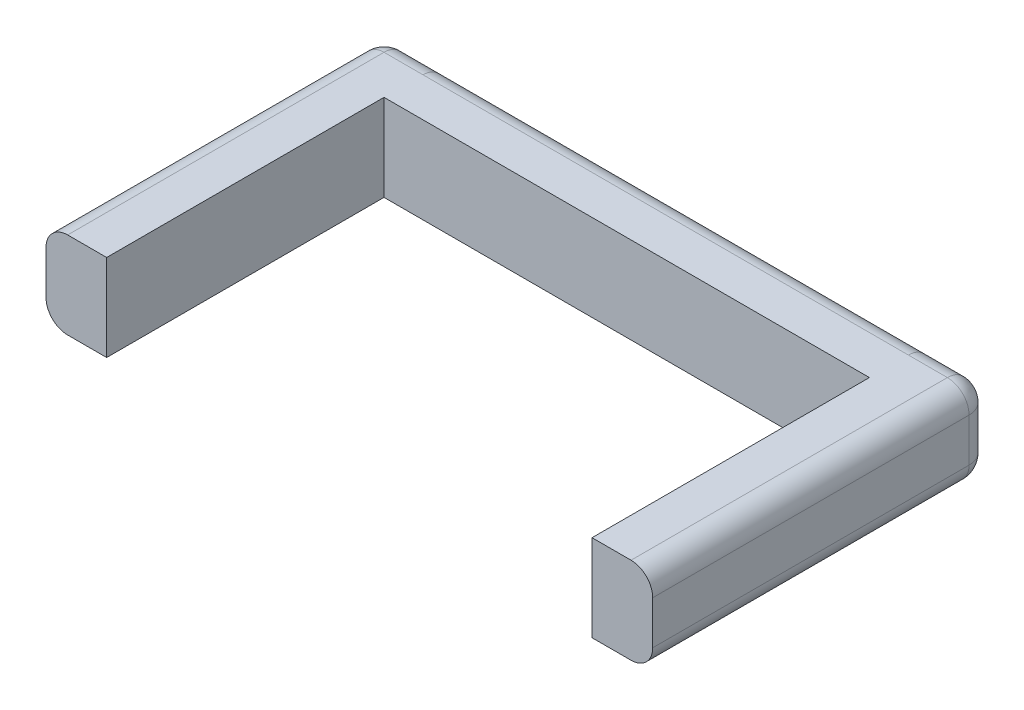
ISO-10303-21;
HEADER;
FILE_DESCRIPTION(('STEP AP214'),'2;1');
FILE_NAME('part.step','',(''),(''),'','','');
FILE_SCHEMA(('AUTOMOTIVE_DESIGN { 1 0 10303 214 1 1 1 1 }'));
ENDSEC;
DATA;
#1=APPLICATION_CONTEXT('core data for automotive mechanical design processes');
#2=APPLICATION_PROTOCOL_DEFINITION('international standard','automotive_design',2000,#1);
#3=PRODUCT_CONTEXT('',#1,'mechanical');
#4=PRODUCT('Part','Part','',(#3));
#5=PRODUCT_RELATED_PRODUCT_CATEGORY('part','',(#4));
#6=PRODUCT_DEFINITION_FORMATION('','',#4);
#7=PRODUCT_DEFINITION_CONTEXT('part definition',#1,'design');
#8=PRODUCT_DEFINITION('design','',#6,#7);
#9=PRODUCT_DEFINITION_SHAPE('','',#8);
#10=(LENGTH_UNIT() NAMED_UNIT(*) SI_UNIT(.MILLI.,.METRE.));
#11=(NAMED_UNIT(*) PLANE_ANGLE_UNIT() SI_UNIT($,.RADIAN.));
#12=(NAMED_UNIT(*) SI_UNIT($,.STERADIAN.) SOLID_ANGLE_UNIT());
#13=UNCERTAINTY_MEASURE_WITH_UNIT(LENGTH_MEASURE(1.E-05),#10,'distance_accuracy_value','');
#14=(GEOMETRIC_REPRESENTATION_CONTEXT(3) GLOBAL_UNCERTAINTY_ASSIGNED_CONTEXT((#13)) GLOBAL_UNIT_ASSIGNED_CONTEXT((#10,
#11,#12)) REPRESENTATION_CONTEXT('',''));
#15=CARTESIAN_POINT('',(0.,0.,0.));
#16=DIRECTION('',(0.,0.,1.));
#17=DIRECTION('',(1.,0.,0.));
#18=AXIS2_PLACEMENT_3D('',#15,#16,#17);
#19=CARTESIAN_POINT('',(355.6,-63.5,-44.45));
#20=DIRECTION('',(0.,0.,1.));
#21=DIRECTION('',(1.,0.,0.));
#22=AXIS2_PLACEMENT_3D('',#19,#20,#21);
#23=PLANE('',#22);
#24=DIRECTION('',(0.,1.,0.));
#25=VECTOR('',#24,1.);
#26=CARTESIAN_POINT('',(412.75,-63.5,-44.45));
#27=LINE('',#26,#25);
#28=CARTESIAN_POINT('',(412.75,31.75,-44.45));
#29=VERTEX_POINT('',#28);
#30=CARTESIAN_POINT('',(412.75,-31.75,-44.45));
#31=VERTEX_POINT('',#30);
#32=EDGE_CURVE('E284',#29,#31,#27,.F.);
#33=ORIENTED_EDGE('',*,*,#32,.T.);
#34=DIRECTION('',(1.,0.,0.));
#35=VECTOR('',#34,1.);
#36=CARTESIAN_POINT('',(355.6,-31.75,-44.45));
#37=LINE('',#36,#35);
#38=CARTESIAN_POINT('',(355.6,-31.75,-44.45));
#39=VERTEX_POINT('',#38);
#40=EDGE_CURVE('E288',#31,#39,#37,.F.);
#41=ORIENTED_EDGE('',*,*,#40,.T.);
#42=DIRECTION('',(-1.,0.,0.));
#43=VECTOR('',#42,1.);
#44=CARTESIAN_POINT('',(355.6,-31.75,-44.45));
#45=LINE('',#44,#43);
#46=CARTESIAN_POINT('',(-355.6,-31.75,-44.45));
#47=VERTEX_POINT('',#46);
#48=EDGE_CURVE('E219',#39,#47,#45,.T.);
#49=ORIENTED_EDGE('',*,*,#48,.T.);
#50=DIRECTION('',(-1.,0.,0.));
#51=VECTOR('',#50,1.);
#52=CARTESIAN_POINT('',(355.6,-31.75,-44.45));
#53=LINE('',#52,#51);
#54=CARTESIAN_POINT('',(-412.75,-31.75,-44.45));
#55=VERTEX_POINT('',#54);
#56=EDGE_CURVE('E243',#47,#55,#53,.T.);
#57=ORIENTED_EDGE('',*,*,#56,.T.);
#58=DIRECTION('',(0.,1.,0.));
#59=VECTOR('',#58,1.);
#60=CARTESIAN_POINT('',(-412.75,63.5,-44.45));
#61=LINE('',#60,#59);
#62=CARTESIAN_POINT('',(-412.75,31.75,-44.45));
#63=VERTEX_POINT('',#62);
#64=EDGE_CURVE('E239',#55,#63,#61,.T.);
#65=ORIENTED_EDGE('',*,*,#64,.T.);
#66=DIRECTION('',(1.,0.,0.));
#67=VECTOR('',#66,1.);
#68=CARTESIAN_POINT('',(355.6,31.75,-44.45));
#69=LINE('',#68,#67);
#70=CARTESIAN_POINT('',(-355.6,31.75,-44.45));
#71=VERTEX_POINT('',#70);
#72=EDGE_CURVE('E241',#63,#71,#69,.T.);
#73=ORIENTED_EDGE('',*,*,#72,.T.);
#74=DIRECTION('',(-1.,0.,0.));
#75=VECTOR('',#74,1.);
#76=CARTESIAN_POINT('',(355.6,31.75,-44.45));
#77=LINE('',#76,#75);
#78=CARTESIAN_POINT('',(355.6,31.75,-44.45));
#79=VERTEX_POINT('',#78);
#80=EDGE_CURVE('E217',#71,#79,#77,.F.);
#81=ORIENTED_EDGE('',*,*,#80,.T.);
#82=DIRECTION('',(-1.,0.,0.));
#83=VECTOR('',#82,1.);
#84=CARTESIAN_POINT('',(355.6,31.75,-44.45));
#85=LINE('',#84,#83);
#86=EDGE_CURVE('E286',#79,#29,#85,.F.);
#87=ORIENTED_EDGE('',*,*,#86,.T.);
#88=EDGE_LOOP('',(#33,#41,#49,#57,#65,#73,#81,#87));
#89=FACE_BOUND('',#88,.T.);
#90=ADVANCED_FACE('F33',(#89),#23,.F.);
#91=CARTESIAN_POINT('',(355.6,63.5,44.45));
#92=DIRECTION('',(0.,-1.,0.));
#93=DIRECTION('',(0.,0.,-1.));
#94=AXIS2_PLACEMENT_3D('',#91,#92,#93);
#95=PLANE('',#94);
#96=DIRECTION('',(0.,0.,-1.));
#97=VECTOR('',#96,1.);
#98=CARTESIAN_POINT('',(412.75,63.5,44.45));
#99=LINE('',#98,#97);
#100=CARTESIAN_POINT('',(412.75,63.5,450.85));
#101=VERTEX_POINT('',#100);
#102=CARTESIAN_POINT('',(412.75,63.5,-12.7));
#103=VERTEX_POINT('',#102);
#104=EDGE_CURVE('E290',#101,#103,#99,.T.);
#105=ORIENTED_EDGE('',*,*,#104,.T.);
#106=DIRECTION('',(-1.,0.,0.));
#107=VECTOR('',#106,1.);
#108=CARTESIAN_POINT('',(355.6,63.5,-12.7));
#109=LINE('',#108,#107);
#110=CARTESIAN_POINT('',(355.6,63.5,-12.7));
#111=VERTEX_POINT('',#110);
#112=EDGE_CURVE('E292',#103,#111,#109,.T.);
#113=ORIENTED_EDGE('',*,*,#112,.T.);
#114=DIRECTION('',(-1.,0.,0.));
#115=VECTOR('',#114,1.);
#116=CARTESIAN_POINT('',(355.6,63.5,-12.7));
#117=LINE('',#116,#115);
#118=CARTESIAN_POINT('',(-355.6,63.5,-12.7));
#119=VERTEX_POINT('',#118);
#120=EDGE_CURVE('E236',#111,#119,#117,.T.);
#121=ORIENTED_EDGE('',*,*,#120,.T.);
#122=DIRECTION('',(1.,0.,0.));
#123=VECTOR('',#122,1.);
#124=CARTESIAN_POINT('',(355.6,63.5,-12.7));
#125=LINE('',#124,#123);
#126=CARTESIAN_POINT('',(-412.75,63.5,-12.7));
#127=VERTEX_POINT('',#126);
#128=EDGE_CURVE('E252',#119,#127,#125,.F.);
#129=ORIENTED_EDGE('',*,*,#128,.T.);
#130=DIRECTION('',(0.,0.,-1.));
#131=VECTOR('',#130,1.);
#132=CARTESIAN_POINT('',(-412.75,63.5,450.85));
#133=LINE('',#132,#131);
#134=CARTESIAN_POINT('',(-412.75,63.5,450.85));
#135=VERTEX_POINT('',#134);
#136=EDGE_CURVE('E250',#127,#135,#133,.F.);
#137=ORIENTED_EDGE('',*,*,#136,.T.);
#138=DIRECTION('',(1.,0.,0.));
#139=VECTOR('',#138,1.);
#140=CARTESIAN_POINT('',(-355.6,63.5,450.85));
#141=LINE('',#140,#139);
#142=CARTESIAN_POINT('',(-355.6,63.5,450.85));
#143=VERTEX_POINT('',#142);
#144=EDGE_CURVE('E202',#135,#143,#141,.T.);
#145=ORIENTED_EDGE('',*,*,#144,.T.);
#146=DIRECTION('',(0.,0.,-1.));
#147=VECTOR('',#146,1.);
#148=CARTESIAN_POINT('',(-355.6,63.5,450.85));
#149=LINE('',#148,#147);
#150=CARTESIAN_POINT('',(-355.6,63.5,44.45));
#151=VERTEX_POINT('',#150);
#152=EDGE_CURVE('E205',#143,#151,#149,.T.);
#153=ORIENTED_EDGE('',*,*,#152,.T.);
#154=DIRECTION('',(-1.,0.,0.));
#155=VECTOR('',#154,1.);
#156=CARTESIAN_POINT('',(355.6,63.5,44.45));
#157=LINE('',#156,#155);
#158=CARTESIAN_POINT('',(355.6,63.5,44.45));
#159=VERTEX_POINT('',#158);
#160=EDGE_CURVE('E175',#159,#151,#157,.T.);
#161=ORIENTED_EDGE('',*,*,#160,.F.);
#162=DIRECTION('',(0.,0.,-1.));
#163=VECTOR('',#162,1.);
#164=CARTESIAN_POINT('',(355.6,63.5,450.85));
#165=LINE('',#164,#163);
#166=CARTESIAN_POINT('',(355.6,63.5,450.85));
#167=VERTEX_POINT('',#166);
#168=EDGE_CURVE('E172',#167,#159,#165,.T.);
#169=ORIENTED_EDGE('',*,*,#168,.F.);
#170=DIRECTION('',(-1.,0.,0.));
#171=VECTOR('',#170,1.);
#172=CARTESIAN_POINT('',(355.6,63.5,450.85));
#173=LINE('',#172,#171);
#174=EDGE_CURVE('E158',#101,#167,#173,.T.);
#175=ORIENTED_EDGE('',*,*,#174,.F.);
#176=EDGE_LOOP('',(#105,#113,#121,#129,#137,#145,#153,#161,#169,#175));
#177=FACE_BOUND('',#176,.T.);
#178=ADVANCED_FACE('F173',(#177),#95,.F.);
#179=CARTESIAN_POINT('',(355.6,-63.5,44.45));
#180=DIRECTION('',(0.,0.,-1.));
#181=DIRECTION('',(-1.,0.,0.));
#182=AXIS2_PLACEMENT_3D('',#179,#180,#181);
#183=PLANE('',#182);
#184=DIRECTION('',(0.,-1.,0.));
#185=VECTOR('',#184,1.);
#186=CARTESIAN_POINT('',(-355.6,-63.5,44.45));
#187=LINE('',#186,#185);
#188=CARTESIAN_POINT('',(-355.6,-63.5,44.45));
#189=VERTEX_POINT('',#188);
#190=EDGE_CURVE('E207',#151,#189,#187,.T.);
#191=ORIENTED_EDGE('',*,*,#190,.T.);
#192=DIRECTION('',(-1.,0.,0.));
#193=VECTOR('',#192,1.);
#194=CARTESIAN_POINT('',(355.6,-63.5,44.45));
#195=LINE('',#194,#193);
#196=CARTESIAN_POINT('',(355.6,-63.5,44.45));
#197=VERTEX_POINT('',#196);
#198=EDGE_CURVE('E212',#197,#189,#195,.T.);
#199=ORIENTED_EDGE('',*,*,#198,.F.);
#200=DIRECTION('',(0.,-1.,0.));
#201=VECTOR('',#200,1.);
#202=CARTESIAN_POINT('',(355.6,-63.5,44.45));
#203=LINE('',#202,#201);
#204=EDGE_CURVE('E210',#159,#197,#203,.T.);
#205=ORIENTED_EDGE('',*,*,#204,.F.);
#206=ORIENTED_EDGE('',*,*,#160,.T.);
#207=EDGE_LOOP('',(#191,#199,#205,#206));
#208=FACE_BOUND('',#207,.T.);
#209=ADVANCED_FACE('F406',(#208),#183,.F.);
#210=CARTESIAN_POINT('',(355.6,-63.5,44.45));
#211=DIRECTION('',(0.,1.,0.));
#212=DIRECTION('',(0.,0.,1.));
#213=AXIS2_PLACEMENT_3D('',#210,#211,#212);
#214=PLANE('',#213);
#215=DIRECTION('',(-1.,0.,0.));
#216=VECTOR('',#215,1.);
#217=CARTESIAN_POINT('',(355.6,-63.5,-12.7));
#218=LINE('',#217,#216);
#219=CARTESIAN_POINT('',(-355.6,-63.5,-12.7));
#220=VERTEX_POINT('',#219);
#221=CARTESIAN_POINT('',(355.6,-63.5,-12.7));
#222=VERTEX_POINT('',#221);
#223=EDGE_CURVE('E228',#220,#222,#218,.F.);
#224=ORIENTED_EDGE('',*,*,#223,.T.);
#225=DIRECTION('',(1.,0.,0.));
#226=VECTOR('',#225,1.);
#227=CARTESIAN_POINT('',(355.6,-63.5,-12.7));
#228=LINE('',#227,#226);
#229=CARTESIAN_POINT('',(412.75,-63.5,-12.7));
#230=VERTEX_POINT('',#229);
#231=EDGE_CURVE('E281',#222,#230,#228,.T.);
#232=ORIENTED_EDGE('',*,*,#231,.T.);
#233=DIRECTION('',(0.,0.,-1.));
#234=VECTOR('',#233,1.);
#235=CARTESIAN_POINT('',(412.75,-63.5,44.45));
#236=LINE('',#235,#234);
#237=CARTESIAN_POINT('',(412.75,-63.5,450.85));
#238=VERTEX_POINT('',#237);
#239=EDGE_CURVE('E264',#230,#238,#236,.F.);
#240=ORIENTED_EDGE('',*,*,#239,.T.);
#241=DIRECTION('',(1.,0.,0.));
#242=VECTOR('',#241,1.);
#243=CARTESIAN_POINT('',(355.6,-63.5,450.85));
#244=LINE('',#243,#242);
#245=CARTESIAN_POINT('',(355.6,-63.5,450.85));
#246=VERTEX_POINT('',#245);
#247=EDGE_CURVE('E180',#246,#238,#244,.T.);
#248=ORIENTED_EDGE('',*,*,#247,.F.);
#249=DIRECTION('',(0.,0.,-1.));
#250=VECTOR('',#249,1.);
#251=CARTESIAN_POINT('',(355.6,-63.5,450.85));
#252=LINE('',#251,#250);
#253=EDGE_CURVE('E179',#246,#197,#252,.T.);
#254=ORIENTED_EDGE('',*,*,#253,.T.);
#255=ORIENTED_EDGE('',*,*,#198,.T.);
#256=DIRECTION('',(0.,0.,-1.));
#257=VECTOR('',#256,1.);
#258=CARTESIAN_POINT('',(-355.6,-63.5,450.85));
#259=LINE('',#258,#257);
#260=CARTESIAN_POINT('',(-355.6,-63.5,450.85));
#261=VERTEX_POINT('',#260);
#262=EDGE_CURVE('E204',#261,#189,#259,.T.);
#263=ORIENTED_EDGE('',*,*,#262,.F.);
#264=DIRECTION('',(-1.,0.,0.));
#265=VECTOR('',#264,1.);
#266=CARTESIAN_POINT('',(-355.6,-63.5,450.85));
#267=LINE('',#266,#265);
#268=CARTESIAN_POINT('',(-412.75,-63.5,450.85));
#269=VERTEX_POINT('',#268);
#270=EDGE_CURVE('E195',#261,#269,#267,.T.);
#271=ORIENTED_EDGE('',*,*,#270,.T.);
#272=DIRECTION('',(0.,0.,-1.));
#273=VECTOR('',#272,1.);
#274=CARTESIAN_POINT('',(-412.75,-63.5,-44.45));
#275=LINE('',#274,#273);
#276=CARTESIAN_POINT('',(-412.75,-63.5,-12.7));
#277=VERTEX_POINT('',#276);
#278=EDGE_CURVE('E246',#269,#277,#275,.T.);
#279=ORIENTED_EDGE('',*,*,#278,.T.);
#280=DIRECTION('',(-1.,0.,0.));
#281=VECTOR('',#280,1.);
#282=CARTESIAN_POINT('',(355.6,-63.5,-12.7));
#283=LINE('',#282,#281);
#284=EDGE_CURVE('E248',#277,#220,#283,.F.);
#285=ORIENTED_EDGE('',*,*,#284,.T.);
#286=EDGE_LOOP('',(#224,#232,#240,#248,#254,#255,#263,#271,#279,#285));
#287=FACE_BOUND('',#286,.T.);
#288=ADVANCED_FACE('F380',(#287),#214,.F.);
#289=CARTESIAN_POINT('',(355.6,-31.75,-12.7));
#290=DIRECTION('',(-1.,0.,0.));
#291=DIRECTION('',(0.,0.,1.));
#292=AXIS2_PLACEMENT_3D('',#289,#290,#291);
#293=CYLINDRICAL_SURFACE('',#292,31.75);
#294=CARTESIAN_POINT('',(355.6,-31.75,-12.7));
#295=DIRECTION('',(-1.,0.,0.));
#296=DIRECTION('',(0.,0.,1.));
#297=AXIS2_PLACEMENT_3D('',#294,#295,#296);
#298=CIRCLE('',#297,31.75);
#299=EDGE_CURVE('E233',#222,#39,#298,.F.);
#300=ORIENTED_EDGE('',*,*,#299,.F.);
#301=ORIENTED_EDGE('',*,*,#223,.F.);
#302=CARTESIAN_POINT('',(-355.6,-31.75,-12.7));
#303=DIRECTION('',(-1.,0.,0.));
#304=DIRECTION('',(0.,0.,1.));
#305=AXIS2_PLACEMENT_3D('',#302,#303,#304);
#306=CIRCLE('',#305,31.75);
#307=EDGE_CURVE('E225',#47,#220,#306,.T.);
#308=ORIENTED_EDGE('',*,*,#307,.F.);
#309=ORIENTED_EDGE('',*,*,#48,.F.);
#310=EDGE_LOOP('',(#300,#301,#308,#309));
#311=FACE_BOUND('',#310,.T.);
#312=ADVANCED_FACE('F344',(#311),#293,.T.);
#313=CARTESIAN_POINT('',(355.6,31.75,-12.7));
#314=DIRECTION('',(-1.,0.,0.));
#315=DIRECTION('',(0.,0.,1.));
#316=AXIS2_PLACEMENT_3D('',#313,#314,#315);
#317=CYLINDRICAL_SURFACE('',#316,31.75);
#318=CARTESIAN_POINT('',(355.6,31.75,-12.7));
#319=DIRECTION('',(-1.,0.,0.));
#320=DIRECTION('',(0.,0.,1.));
#321=AXIS2_PLACEMENT_3D('',#318,#319,#320);
#322=CIRCLE('',#321,31.75);
#323=EDGE_CURVE('E230',#79,#111,#322,.F.);
#324=ORIENTED_EDGE('',*,*,#323,.F.);
#325=ORIENTED_EDGE('',*,*,#80,.F.);
#326=CARTESIAN_POINT('',(-355.6,31.75,-12.7));
#327=DIRECTION('',(-1.,0.,0.));
#328=DIRECTION('',(0.,0.,1.));
#329=AXIS2_PLACEMENT_3D('',#326,#327,#328);
#330=CIRCLE('',#329,31.75);
#331=EDGE_CURVE('E222',#119,#71,#330,.T.);
#332=ORIENTED_EDGE('',*,*,#331,.F.);
#333=ORIENTED_EDGE('',*,*,#120,.F.);
#334=EDGE_LOOP('',(#324,#325,#332,#333));
#335=FACE_BOUND('',#334,.T.);
#336=ADVANCED_FACE('F391',(#335),#317,.T.);
#337=CARTESIAN_POINT('',(-355.6,63.5,450.85));
#338=DIRECTION('',(1.,0.,0.));
#339=DIRECTION('',(0.,0.,-1.));
#340=AXIS2_PLACEMENT_3D('',#337,#338,#339);
#341=PLANE('',#340);
#342=ORIENTED_EDGE('',*,*,#190,.F.);
#343=ORIENTED_EDGE('',*,*,#152,.F.);
#344=DIRECTION('',(0.,-1.,0.));
#345=VECTOR('',#344,1.);
#346=CARTESIAN_POINT('',(-355.6,63.5,450.85));
#347=LINE('',#346,#345);
#348=EDGE_CURVE('E192',#143,#261,#347,.T.);
#349=ORIENTED_EDGE('',*,*,#348,.T.);
#350=ORIENTED_EDGE('',*,*,#262,.T.);
#351=EDGE_LOOP('',(#342,#343,#349,#350));
#352=FACE_BOUND('',#351,.T.);
#353=ADVANCED_FACE('F383',(#352),#341,.T.);
#354=CARTESIAN_POINT('',(-444.5,63.5,450.85));
#355=DIRECTION('',(-1.,0.,0.));
#356=DIRECTION('',(0.,0.,1.));
#357=AXIS2_PLACEMENT_3D('',#354,#355,#356);
#358=PLANE('',#357);
#359=DIRECTION('',(0.,1.,0.));
#360=VECTOR('',#359,1.);
#361=CARTESIAN_POINT('',(-444.5,-63.5,-12.7));
#362=LINE('',#361,#360);
#363=CARTESIAN_POINT('',(-444.5,31.75,-12.7));
#364=VERTEX_POINT('',#363);
#365=CARTESIAN_POINT('',(-444.5,-31.75,-12.7));
#366=VERTEX_POINT('',#365);
#367=EDGE_CURVE('E256',#364,#366,#362,.F.);
#368=ORIENTED_EDGE('',*,*,#367,.T.);
#369=DIRECTION('',(0.,0.,-1.));
#370=VECTOR('',#369,1.);
#371=CARTESIAN_POINT('',(-444.5,-31.75,450.85));
#372=LINE('',#371,#370);
#373=CARTESIAN_POINT('',(-444.5,-31.75,450.85));
#374=VERTEX_POINT('',#373);
#375=EDGE_CURVE('E258',#366,#374,#372,.F.);
#376=ORIENTED_EDGE('',*,*,#375,.T.);
#377=DIRECTION('',(0.,1.,0.));
#378=VECTOR('',#377,1.);
#379=CARTESIAN_POINT('',(-444.5,63.5,450.85));
#380=LINE('',#379,#378);
#381=CARTESIAN_POINT('',(-444.5,31.75,450.85));
#382=VERTEX_POINT('',#381);
#383=EDGE_CURVE('E199',#374,#382,#380,.T.);
#384=ORIENTED_EDGE('',*,*,#383,.T.);
#385=DIRECTION('',(0.,0.,-1.));
#386=VECTOR('',#385,1.);
#387=CARTESIAN_POINT('',(-444.5,31.75,-44.45));
#388=LINE('',#387,#386);
#389=EDGE_CURVE('E254',#382,#364,#388,.T.);
#390=ORIENTED_EDGE('',*,*,#389,.T.);
#391=EDGE_LOOP('',(#368,#376,#384,#390));
#392=FACE_BOUND('',#391,.T.);
#393=ADVANCED_FACE('F367',(#392),#358,.T.);
#394=CARTESIAN_POINT('',(0.,0.,450.85));
#395=DIRECTION('',(0.,0.,-1.));
#396=DIRECTION('',(-1.,0.,0.));
#397=AXIS2_PLACEMENT_3D('',#394,#395,#396);
#398=PLANE('',#397);
#399=ORIENTED_EDGE('',*,*,#383,.F.);
#400=CARTESIAN_POINT('',(-412.75,-31.75,450.85));
#401=DIRECTION('',(0.,0.,-1.));
#402=DIRECTION('',(-1.,0.,0.));
#403=AXIS2_PLACEMENT_3D('',#400,#401,#402);
#404=CIRCLE('',#403,31.75);
#405=EDGE_CURVE('E262',#374,#269,#404,.F.);
#406=ORIENTED_EDGE('',*,*,#405,.T.);
#407=ORIENTED_EDGE('',*,*,#270,.F.);
#408=ORIENTED_EDGE('',*,*,#348,.F.);
#409=ORIENTED_EDGE('',*,*,#144,.F.);
#410=CARTESIAN_POINT('',(-412.75,31.75,450.85));
#411=DIRECTION('',(0.,0.,-1.));
#412=DIRECTION('',(-1.,0.,0.));
#413=AXIS2_PLACEMENT_3D('',#410,#411,#412);
#414=CIRCLE('',#413,31.75);
#415=EDGE_CURVE('E260',#135,#382,#414,.F.);
#416=ORIENTED_EDGE('',*,*,#415,.T.);
#417=EDGE_LOOP('',(#399,#406,#407,#408,#409,#416));
#418=FACE_BOUND('',#417,.T.);
#419=ADVANCED_FACE('F377',(#418),#398,.F.);
#420=CARTESIAN_POINT('',(355.6,31.75,-12.7));
#421=DIRECTION('',(1.,0.,0.));
#422=DIRECTION('',(0.,0.,-1.));
#423=AXIS2_PLACEMENT_3D('',#420,#421,#422);
#424=CYLINDRICAL_SURFACE('',#423,31.75);
#425=ORIENTED_EDGE('',*,*,#331,.T.);
#426=ORIENTED_EDGE('',*,*,#72,.F.);
#427=CARTESIAN_POINT('',(-412.75,31.75,-12.7));
#428=DIRECTION('',(-1.,0.,0.));
#429=DIRECTION('',(0.,0.,1.));
#430=AXIS2_PLACEMENT_3D('',#427,#428,#429);
#431=CIRCLE('',#430,31.75);
#432=EDGE_CURVE('E196',#127,#63,#431,.T.);
#433=ORIENTED_EDGE('',*,*,#432,.F.);
#434=ORIENTED_EDGE('',*,*,#128,.F.);
#435=EDGE_LOOP('',(#425,#426,#433,#434));
#436=FACE_BOUND('',#435,.T.);
#437=ADVANCED_FACE('F357',(#436),#424,.T.);
#438=CARTESIAN_POINT('',(-412.75,31.75,450.85));
#439=DIRECTION('',(0.,0.,1.));
#440=DIRECTION('',(1.,0.,0.));
#441=AXIS2_PLACEMENT_3D('',#438,#439,#440);
#442=CYLINDRICAL_SURFACE('',#441,31.75);
#443=ORIENTED_EDGE('',*,*,#415,.F.);
#444=ORIENTED_EDGE('',*,*,#136,.F.);
#445=CARTESIAN_POINT('',(-412.75,31.75,-12.7));
#446=DIRECTION('',(0.,0.,-1.));
#447=DIRECTION('',(-1.,0.,0.));
#448=AXIS2_PLACEMENT_3D('',#445,#446,#447);
#449=CIRCLE('',#448,31.75);
#450=EDGE_CURVE('E275',#364,#127,#449,.T.);
#451=ORIENTED_EDGE('',*,*,#450,.F.);
#452=ORIENTED_EDGE('',*,*,#389,.F.);
#453=EDGE_LOOP('',(#443,#444,#451,#452));
#454=FACE_BOUND('',#453,.T.);
#455=ADVANCED_FACE('F389',(#454),#442,.T.);
#456=CARTESIAN_POINT('',(-412.75,31.75,-12.7));
#457=DIRECTION('',(0.,0.,1.));
#458=DIRECTION('',(1.,0.,0.));
#459=AXIS2_PLACEMENT_3D('',#456,#457,#458);
#460=SPHERICAL_SURFACE('',#459,31.75);
#461=ORIENTED_EDGE('',*,*,#450,.T.);
#462=ORIENTED_EDGE('',*,*,#432,.T.);
#463=CARTESIAN_POINT('',(-412.75,31.75,-12.7));
#464=DIRECTION('',(0.,1.,0.));
#465=DIRECTION('',(0.,0.,1.));
#466=AXIS2_PLACEMENT_3D('',#463,#464,#465);
#467=CIRCLE('',#466,31.75);
#468=EDGE_CURVE('E272',#364,#63,#467,.F.);
#469=ORIENTED_EDGE('',*,*,#468,.F.);
#470=EDGE_LOOP('',(#461,#462,#469));
#471=FACE_BOUND('',#470,.T.);
#472=ADVANCED_FACE('F361',(#471),#460,.T.);
#473=CARTESIAN_POINT('',(-412.75,-63.5,-12.7));
#474=DIRECTION('',(0.,-1.,0.));
#475=DIRECTION('',(0.,0.,-1.));
#476=AXIS2_PLACEMENT_3D('',#473,#474,#475);
#477=CYLINDRICAL_SURFACE('',#476,31.75);
#478=ORIENTED_EDGE('',*,*,#468,.T.);
#479=ORIENTED_EDGE('',*,*,#64,.F.);
#480=CARTESIAN_POINT('',(-412.75,-31.75,-12.7));
#481=DIRECTION('',(0.,-1.,0.));
#482=DIRECTION('',(0.,0.,-1.));
#483=AXIS2_PLACEMENT_3D('',#480,#481,#482);
#484=CIRCLE('',#483,31.75);
#485=EDGE_CURVE('E269',#366,#55,#484,.T.);
#486=ORIENTED_EDGE('',*,*,#485,.F.);
#487=ORIENTED_EDGE('',*,*,#367,.F.);
#488=EDGE_LOOP('',(#478,#479,#486,#487));
#489=FACE_BOUND('',#488,.T.);
#490=ADVANCED_FACE('F364',(#489),#477,.T.);
#491=CARTESIAN_POINT('',(-412.75,-31.75,44.45));
#492=DIRECTION('',(0.,0.,1.));
#493=DIRECTION('',(1.,0.,0.));
#494=AXIS2_PLACEMENT_3D('',#491,#492,#493);
#495=CYLINDRICAL_SURFACE('',#494,31.75);
#496=ORIENTED_EDGE('',*,*,#405,.F.);
#497=ORIENTED_EDGE('',*,*,#375,.F.);
#498=CARTESIAN_POINT('',(-412.75,-31.75,-12.7));
#499=DIRECTION('',(0.,0.,-1.));
#500=DIRECTION('',(-1.,0.,0.));
#501=AXIS2_PLACEMENT_3D('',#498,#499,#500);
#502=CIRCLE('',#501,31.75);
#503=EDGE_CURVE('E266',#277,#366,#502,.T.);
#504=ORIENTED_EDGE('',*,*,#503,.F.);
#505=ORIENTED_EDGE('',*,*,#278,.F.);
#506=EDGE_LOOP('',(#496,#497,#504,#505));
#507=FACE_BOUND('',#506,.T.);
#508=ADVANCED_FACE('F373',(#507),#495,.T.);
#509=CARTESIAN_POINT('',(-412.75,-31.75,-12.7));
#510=DIRECTION('',(0.,0.,1.));
#511=DIRECTION('',(1.,0.,0.));
#512=AXIS2_PLACEMENT_3D('',#509,#510,#511);
#513=SPHERICAL_SURFACE('',#512,31.75);
#514=ORIENTED_EDGE('',*,*,#503,.T.);
#515=ORIENTED_EDGE('',*,*,#485,.T.);
#516=CARTESIAN_POINT('',(-412.75,-31.75,-12.7));
#517=DIRECTION('',(-1.,0.,0.));
#518=DIRECTION('',(0.,0.,1.));
#519=AXIS2_PLACEMENT_3D('',#516,#517,#518);
#520=CIRCLE('',#519,31.75);
#521=EDGE_CURVE('E190',#277,#55,#520,.F.);
#522=ORIENTED_EDGE('',*,*,#521,.F.);
#523=EDGE_LOOP('',(#514,#515,#522));
#524=FACE_BOUND('',#523,.T.);
#525=ADVANCED_FACE('F452',(#524),#513,.T.);
#526=CARTESIAN_POINT('',(355.6,-31.75,-12.7));
#527=DIRECTION('',(-1.,0.,0.));
#528=DIRECTION('',(0.,0.,1.));
#529=AXIS2_PLACEMENT_3D('',#526,#527,#528);
#530=CYLINDRICAL_SURFACE('',#529,31.75);
#531=ORIENTED_EDGE('',*,*,#307,.T.);
#532=ORIENTED_EDGE('',*,*,#284,.F.);
#533=ORIENTED_EDGE('',*,*,#521,.T.);
#534=ORIENTED_EDGE('',*,*,#56,.F.);
#535=EDGE_LOOP('',(#531,#532,#533,#534));
#536=FACE_BOUND('',#535,.T.);
#537=ADVANCED_FACE('F348',(#536),#530,.T.);
#538=CARTESIAN_POINT('',(355.6,63.5,450.85));
#539=DIRECTION('',(1.,0.,0.));
#540=DIRECTION('',(0.,0.,-1.));
#541=AXIS2_PLACEMENT_3D('',#538,#539,#540);
#542=PLANE('',#541);
#543=ORIENTED_EDGE('',*,*,#168,.T.);
#544=ORIENTED_EDGE('',*,*,#204,.T.);
#545=ORIENTED_EDGE('',*,*,#253,.F.);
#546=DIRECTION('',(0.,-1.,0.));
#547=VECTOR('',#546,1.);
#548=CARTESIAN_POINT('',(355.6,63.5,450.85));
#549=LINE('',#548,#547);
#550=EDGE_CURVE('E163',#167,#246,#549,.T.);
#551=ORIENTED_EDGE('',*,*,#550,.F.);
#552=EDGE_LOOP('',(#543,#544,#545,#551));
#553=FACE_BOUND('',#552,.T.);
#554=ADVANCED_FACE('F182',(#553),#542,.F.);
#555=CARTESIAN_POINT('',(444.5,63.5,450.85));
#556=DIRECTION('',(-1.,0.,0.));
#557=DIRECTION('',(0.,0.,1.));
#558=AXIS2_PLACEMENT_3D('',#555,#556,#557);
#559=PLANE('',#558);
#560=DIRECTION('',(0.,1.,0.));
#561=VECTOR('',#560,1.);
#562=CARTESIAN_POINT('',(444.5,63.5,450.85));
#563=LINE('',#562,#561);
#564=CARTESIAN_POINT('',(444.5,-31.75,450.85));
#565=VERTEX_POINT('',#564);
#566=CARTESIAN_POINT('',(444.5,31.75,450.85));
#567=VERTEX_POINT('',#566);
#568=EDGE_CURVE('E169',#565,#567,#563,.T.);
#569=ORIENTED_EDGE('',*,*,#568,.F.);
#570=DIRECTION('',(0.,0.,-1.));
#571=VECTOR('',#570,1.);
#572=CARTESIAN_POINT('',(444.5,-31.75,450.85));
#573=LINE('',#572,#571);
#574=CARTESIAN_POINT('',(444.5,-31.75,-12.7));
#575=VERTEX_POINT('',#574);
#576=EDGE_CURVE('E50',#565,#575,#573,.T.);
#577=ORIENTED_EDGE('',*,*,#576,.T.);
#578=DIRECTION('',(0.,1.,0.));
#579=VECTOR('',#578,1.);
#580=CARTESIAN_POINT('',(444.5,63.5,-12.7));
#581=LINE('',#580,#579);
#582=CARTESIAN_POINT('',(444.5,31.75,-12.7));
#583=VERTEX_POINT('',#582);
#584=EDGE_CURVE('E54',#575,#583,#581,.T.);
#585=ORIENTED_EDGE('',*,*,#584,.T.);
#586=DIRECTION('',(0.,0.,-1.));
#587=VECTOR('',#586,1.);
#588=CARTESIAN_POINT('',(444.5,31.75,450.85));
#589=LINE('',#588,#587);
#590=EDGE_CURVE('E294',#583,#567,#589,.F.);
#591=ORIENTED_EDGE('',*,*,#590,.T.);
#592=EDGE_LOOP('',(#569,#577,#585,#591));
#593=FACE_BOUND('',#592,.T.);
#594=ADVANCED_FACE('F323',(#593),#559,.F.);
#595=CARTESIAN_POINT('',(0.,0.,450.85));
#596=DIRECTION('',(0.,0.,-1.));
#597=DIRECTION('',(1.,0.,0.));
#598=AXIS2_PLACEMENT_3D('',#595,#596,#597);
#599=PLANE('',#598);
#600=ORIENTED_EDGE('',*,*,#247,.T.);
#601=CARTESIAN_POINT('',(412.75,-31.75,450.85));
#602=DIRECTION('',(0.,0.,-1.));
#603=DIRECTION('',(-1.,0.,0.));
#604=AXIS2_PLACEMENT_3D('',#601,#602,#603);
#605=CIRCLE('',#604,31.75);
#606=EDGE_CURVE('E11',#238,#565,#605,.F.);
#607=ORIENTED_EDGE('',*,*,#606,.T.);
#608=ORIENTED_EDGE('',*,*,#568,.T.);
#609=CARTESIAN_POINT('',(412.75,31.75,450.85));
#610=DIRECTION('',(0.,0.,-1.));
#611=DIRECTION('',(-1.,0.,0.));
#612=AXIS2_PLACEMENT_3D('',#609,#610,#611);
#613=CIRCLE('',#612,31.75);
#614=EDGE_CURVE('E42',#567,#101,#613,.F.);
#615=ORIENTED_EDGE('',*,*,#614,.T.);
#616=ORIENTED_EDGE('',*,*,#174,.T.);
#617=ORIENTED_EDGE('',*,*,#550,.T.);
#618=EDGE_LOOP('',(#600,#607,#608,#615,#616,#617));
#619=FACE_BOUND('',#618,.T.);
#620=ADVANCED_FACE('F161',(#619),#599,.F.);
#621=CARTESIAN_POINT('',(412.75,31.75,44.45));
#622=DIRECTION('',(0.,0.,-1.));
#623=DIRECTION('',(-1.,0.,0.));
#624=AXIS2_PLACEMENT_3D('',#621,#622,#623);
#625=CYLINDRICAL_SURFACE('',#624,31.75);
#626=ORIENTED_EDGE('',*,*,#614,.F.);
#627=ORIENTED_EDGE('',*,*,#590,.F.);
#628=CARTESIAN_POINT('',(412.75,31.75,-12.7));
#629=DIRECTION('',(0.,0.,-1.));
#630=DIRECTION('',(-1.,0.,0.));
#631=AXIS2_PLACEMENT_3D('',#628,#629,#630);
#632=CIRCLE('',#631,31.75);
#633=EDGE_CURVE('E37',#103,#583,#632,.T.);
#634=ORIENTED_EDGE('',*,*,#633,.F.);
#635=ORIENTED_EDGE('',*,*,#104,.F.);
#636=EDGE_LOOP('',(#626,#627,#634,#635));
#637=FACE_BOUND('',#636,.T.);
#638=ADVANCED_FACE('F35',(#637),#625,.T.);
#639=CARTESIAN_POINT('',(355.6,31.75,-12.7));
#640=DIRECTION('',(-1.,0.,0.));
#641=DIRECTION('',(0.,0.,1.));
#642=AXIS2_PLACEMENT_3D('',#639,#640,#641);
#643=CYLINDRICAL_SURFACE('',#642,31.75);
#644=ORIENTED_EDGE('',*,*,#323,.T.);
#645=ORIENTED_EDGE('',*,*,#112,.F.);
#646=CARTESIAN_POINT('',(412.75,31.75,-12.7));
#647=DIRECTION('',(1.,0.,0.));
#648=DIRECTION('',(0.,0.,-1.));
#649=AXIS2_PLACEMENT_3D('',#646,#647,#648);
#650=CIRCLE('',#649,31.75);
#651=EDGE_CURVE('E186',#29,#103,#650,.T.);
#652=ORIENTED_EDGE('',*,*,#651,.F.);
#653=ORIENTED_EDGE('',*,*,#86,.F.);
#654=EDGE_LOOP('',(#644,#645,#652,#653));
#655=FACE_BOUND('',#654,.T.);
#656=ADVANCED_FACE('F319',(#655),#643,.T.);
#657=CARTESIAN_POINT('',(412.75,31.75,-12.7));
#658=DIRECTION('',(0.,0.,1.));
#659=DIRECTION('',(1.,0.,0.));
#660=AXIS2_PLACEMENT_3D('',#657,#658,#659);
#661=SPHERICAL_SURFACE('',#660,31.75);
#662=ORIENTED_EDGE('',*,*,#651,.T.);
#663=ORIENTED_EDGE('',*,*,#633,.T.);
#664=CARTESIAN_POINT('',(412.75,31.75,-12.7));
#665=DIRECTION('',(0.,1.,0.));
#666=DIRECTION('',(0.,0.,1.));
#667=AXIS2_PLACEMENT_3D('',#664,#665,#666);
#668=CIRCLE('',#667,31.75);
#669=EDGE_CURVE('E307',#29,#583,#668,.F.);
#670=ORIENTED_EDGE('',*,*,#669,.F.);
#671=EDGE_LOOP('',(#662,#663,#670));
#672=FACE_BOUND('',#671,.T.);
#673=ADVANCED_FACE('F313',(#672),#661,.T.);
#674=CARTESIAN_POINT('',(412.75,-31.75,450.85));
#675=DIRECTION('',(0.,0.,-1.));
#676=DIRECTION('',(-1.,0.,0.));
#677=AXIS2_PLACEMENT_3D('',#674,#675,#676);
#678=CYLINDRICAL_SURFACE('',#677,31.75);
#679=ORIENTED_EDGE('',*,*,#606,.F.);
#680=ORIENTED_EDGE('',*,*,#239,.F.);
#681=CARTESIAN_POINT('',(412.75,-31.75,-12.7));
#682=DIRECTION('',(0.,0.,-1.));
#683=DIRECTION('',(0.,1.,0.));
#684=AXIS2_PLACEMENT_3D('',#681,#682,#683);
#685=CIRCLE('',#684,31.75);
#686=EDGE_CURVE('E304',#575,#230,#685,.T.);
#687=ORIENTED_EDGE('',*,*,#686,.F.);
#688=ORIENTED_EDGE('',*,*,#576,.F.);
#689=EDGE_LOOP('',(#679,#680,#687,#688));
#690=FACE_BOUND('',#689,.T.);
#691=ADVANCED_FACE('F327',(#690),#678,.T.);
#692=CARTESIAN_POINT('',(412.75,63.5,-12.7));
#693=DIRECTION('',(0.,1.,0.));
#694=DIRECTION('',(0.,0.,1.));
#695=AXIS2_PLACEMENT_3D('',#692,#693,#694);
#696=CYLINDRICAL_SURFACE('',#695,31.75);
#697=ORIENTED_EDGE('',*,*,#669,.T.);
#698=ORIENTED_EDGE('',*,*,#584,.F.);
#699=CARTESIAN_POINT('',(412.75,-31.75,-12.7));
#700=DIRECTION('',(0.,-1.,0.));
#701=DIRECTION('',(0.,0.,-1.));
#702=AXIS2_PLACEMENT_3D('',#699,#700,#701);
#703=CIRCLE('',#702,31.75);
#704=EDGE_CURVE('E301',#31,#575,#703,.T.);
#705=ORIENTED_EDGE('',*,*,#704,.F.);
#706=ORIENTED_EDGE('',*,*,#32,.F.);
#707=EDGE_LOOP('',(#697,#698,#705,#706));
#708=FACE_BOUND('',#707,.T.);
#709=ADVANCED_FACE('F335',(#708),#696,.T.);
#710=CARTESIAN_POINT('',(412.75,-31.75,-12.7));
#711=DIRECTION('',(0.,0.,1.));
#712=DIRECTION('',(1.,0.,0.));
#713=AXIS2_PLACEMENT_3D('',#710,#711,#712);
#714=SPHERICAL_SURFACE('',#713,31.75);
#715=ORIENTED_EDGE('',*,*,#704,.T.);
#716=ORIENTED_EDGE('',*,*,#686,.T.);
#717=CARTESIAN_POINT('',(412.75,-31.75,-12.7));
#718=DIRECTION('',(1.,0.,0.));
#719=DIRECTION('',(0.,0.,-1.));
#720=AXIS2_PLACEMENT_3D('',#717,#718,#719);
#721=CIRCLE('',#720,31.75);
#722=EDGE_CURVE('E299',#31,#230,#721,.F.);
#723=ORIENTED_EDGE('',*,*,#722,.F.);
#724=EDGE_LOOP('',(#715,#716,#723));
#725=FACE_BOUND('',#724,.T.);
#726=ADVANCED_FACE('F332',(#725),#714,.T.);
#727=CARTESIAN_POINT('',(355.6,-31.75,-12.7));
#728=DIRECTION('',(1.,0.,0.));
#729=DIRECTION('',(0.,0.,-1.));
#730=AXIS2_PLACEMENT_3D('',#727,#728,#729);
#731=CYLINDRICAL_SURFACE('',#730,31.75);
#732=ORIENTED_EDGE('',*,*,#299,.T.);
#733=ORIENTED_EDGE('',*,*,#40,.F.);
#734=ORIENTED_EDGE('',*,*,#722,.T.);
#735=ORIENTED_EDGE('',*,*,#231,.F.);
#736=EDGE_LOOP('',(#732,#733,#734,#735));
#737=FACE_BOUND('',#736,.T.);
#738=ADVANCED_FACE('F337',(#737),#731,.T.);
#739=CLOSED_SHELL('',(#90,#178,#209,#288,#312,#336,#353,#393,#419,#437,#455,#472,#490,#508,#525,
#537,#554,#594,#620,#638,#656,#673,#691,#709,#726,#738));
#740=MANIFOLD_SOLID_BREP('B2',#739);
#741=ADVANCED_BREP_SHAPE_REPRESENTATION('',(#18,#740),#14);
#742=SHAPE_DEFINITION_REPRESENTATION(#9,#741);
ENDSEC;
END-ISO-10303-21;
